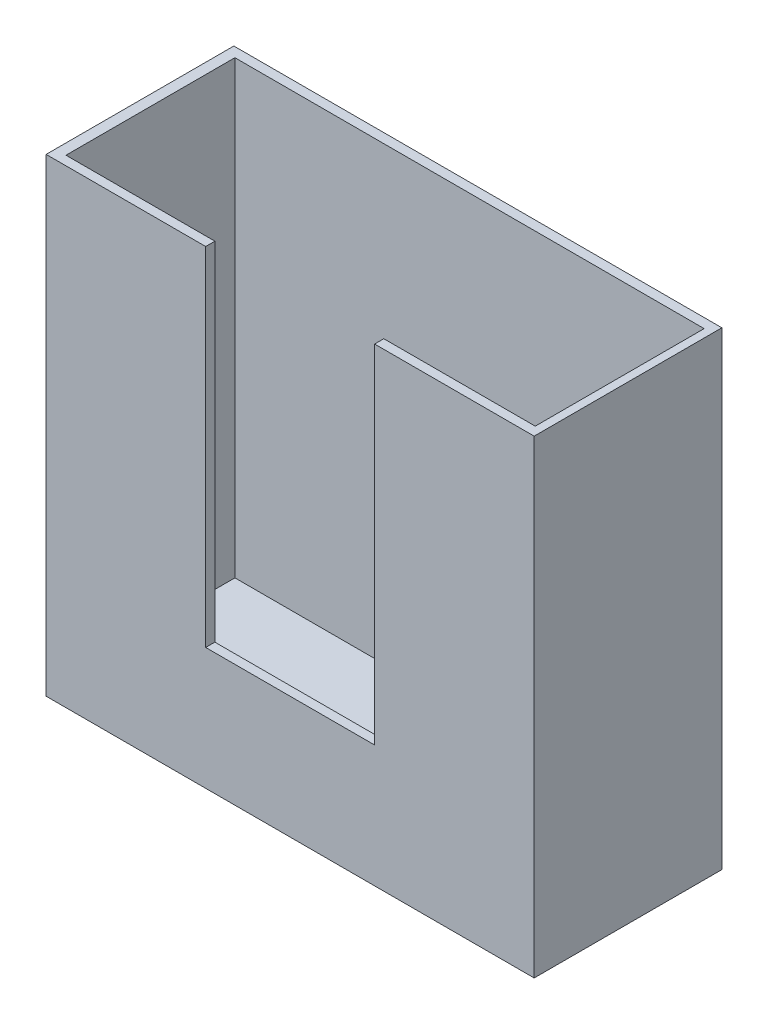
ISO-10303-21;
HEADER;
FILE_DESCRIPTION(('STEP AP214'),'2;1');
FILE_NAME('part.step','',(''),(''),'','','');
FILE_SCHEMA(('AUTOMOTIVE_DESIGN { 1 0 10303 214 1 1 1 1 }'));
ENDSEC;
DATA;
#1=APPLICATION_CONTEXT('core data for automotive mechanical design processes');
#2=APPLICATION_PROTOCOL_DEFINITION('international standard','automotive_design',2000,#1);
#3=PRODUCT_CONTEXT('',#1,'mechanical');
#4=PRODUCT('Part','Part','',(#3));
#5=PRODUCT_RELATED_PRODUCT_CATEGORY('part','',(#4));
#6=PRODUCT_DEFINITION_FORMATION('','',#4);
#7=PRODUCT_DEFINITION_CONTEXT('part definition',#1,'design');
#8=PRODUCT_DEFINITION('design','',#6,#7);
#9=PRODUCT_DEFINITION_SHAPE('','',#8);
#10=(LENGTH_UNIT() NAMED_UNIT(*) SI_UNIT(.MILLI.,.METRE.));
#11=(NAMED_UNIT(*) PLANE_ANGLE_UNIT() SI_UNIT($,.RADIAN.));
#12=(NAMED_UNIT(*) SI_UNIT($,.STERADIAN.) SOLID_ANGLE_UNIT());
#13=UNCERTAINTY_MEASURE_WITH_UNIT(LENGTH_MEASURE(1.E-05),#10,'distance_accuracy_value','');
#14=(GEOMETRIC_REPRESENTATION_CONTEXT(3) GLOBAL_UNCERTAINTY_ASSIGNED_CONTEXT((#13)) GLOBAL_UNIT_ASSIGNED_CONTEXT((#10,
#11,#12)) REPRESENTATION_CONTEXT('',''));
#15=CARTESIAN_POINT('',(0.,0.,0.));
#16=DIRECTION('',(0.,0.,1.));
#17=DIRECTION('',(1.,0.,0.));
#18=AXIS2_PLACEMENT_3D('',#15,#16,#17);
#19=CARTESIAN_POINT('',(13.,12.5,10.));
#20=DIRECTION('',(0.,-1.,0.));
#21=DIRECTION('',(1.,0.,0.));
#22=AXIS2_PLACEMENT_3D('',#19,#20,#21);
#23=PLANE('',#22);
#24=DIRECTION('',(-1.,0.,0.));
#25=VECTOR('',#24,1.);
#26=CARTESIAN_POINT('',(13.,12.5,10.));
#27=LINE('',#26,#25);
#28=CARTESIAN_POINT('',(-4.5,12.5,10.));
#29=VERTEX_POINT('',#28);
#30=CARTESIAN_POINT('',(-13.,12.5,10.));
#31=VERTEX_POINT('',#30);
#32=EDGE_CURVE('E182',#29,#31,#27,.T.);
#33=ORIENTED_EDGE('',*,*,#32,.F.);
#34=DIRECTION('',(0.,0.,1.));
#35=VECTOR('',#34,1.);
#36=CARTESIAN_POINT('',(-4.5,12.5,5.));
#37=LINE('',#36,#35);
#38=CARTESIAN_POINT('',(-4.5,12.5,9.51050607817674));
#39=VERTEX_POINT('',#38);
#40=EDGE_CURVE('E146',#39,#29,#37,.T.);
#41=ORIENTED_EDGE('',*,*,#40,.F.);
#42=DIRECTION('',(1.,0.,0.));
#43=VECTOR('',#42,1.);
#44=CARTESIAN_POINT('',(-12.4321877572133,12.5,9.51050607817674));
#45=LINE('',#44,#43);
#46=CARTESIAN_POINT('',(-12.4321877572133,12.5,9.51050607817674));
#47=VERTEX_POINT('',#46);
#48=EDGE_CURVE('E161',#47,#39,#45,.T.);
#49=ORIENTED_EDGE('',*,*,#48,.F.);
#50=DIRECTION('',(0.,0.,1.));
#51=VECTOR('',#50,1.);
#52=CARTESIAN_POINT('',(-12.4321877572133,12.5,0.510506078176745));
#53=LINE('',#52,#51);
#54=CARTESIAN_POINT('',(-12.4321877572133,12.5,0.510506078176745));
#55=VERTEX_POINT('',#54);
#56=EDGE_CURVE('E153',#55,#47,#53,.T.);
#57=ORIENTED_EDGE('',*,*,#56,.F.);
#58=DIRECTION('',(1.,0.,0.));
#59=VECTOR('',#58,1.);
#60=CARTESIAN_POINT('',(-12.4321877572133,12.5,0.510506078176745));
#61=LINE('',#60,#59);
#62=CARTESIAN_POINT('',(12.5678122427867,12.5,0.510506078176745));
#63=VERTEX_POINT('',#62);
#64=EDGE_CURVE('E167',#55,#63,#61,.T.);
#65=ORIENTED_EDGE('',*,*,#64,.T.);
#66=DIRECTION('',(0.,0.,1.));
#67=VECTOR('',#66,1.);
#68=CARTESIAN_POINT('',(12.5678122427867,12.5,0.510506078176745));
#69=LINE('',#68,#67);
#70=CARTESIAN_POINT('',(12.5678122427867,12.5,9.51050607817674));
#71=VERTEX_POINT('',#70);
#72=EDGE_CURVE('E164',#63,#71,#69,.T.);
#73=ORIENTED_EDGE('',*,*,#72,.T.);
#74=CARTESIAN_POINT('',(4.5,12.5,9.51050607817674));
#75=VERTEX_POINT('',#74);
#76=EDGE_CURVE('E53',#75,#71,#45,.T.);
#77=ORIENTED_EDGE('',*,*,#76,.F.);
#78=DIRECTION('',(0.,0.,1.));
#79=VECTOR('',#78,1.);
#80=CARTESIAN_POINT('',(4.5,12.5,5.));
#81=LINE('',#80,#79);
#82=CARTESIAN_POINT('',(4.5,12.5,10.));
#83=VERTEX_POINT('',#82);
#84=EDGE_CURVE('E46',#75,#83,#81,.T.);
#85=ORIENTED_EDGE('',*,*,#84,.T.);
#86=CARTESIAN_POINT('',(13.,12.5,10.));
#87=VERTEX_POINT('',#86);
#88=EDGE_CURVE('E141',#87,#83,#27,.T.);
#89=ORIENTED_EDGE('',*,*,#88,.F.);
#90=DIRECTION('',(0.,0.,-1.));
#91=VECTOR('',#90,1.);
#92=CARTESIAN_POINT('',(13.,12.5,10.));
#93=LINE('',#92,#91);
#94=CARTESIAN_POINT('',(13.,12.5,0.));
#95=VERTEX_POINT('',#94);
#96=EDGE_CURVE('E190',#87,#95,#93,.T.);
#97=ORIENTED_EDGE('',*,*,#96,.T.);
#98=DIRECTION('',(-1.,0.,0.));
#99=VECTOR('',#98,1.);
#100=CARTESIAN_POINT('',(13.,12.5,0.));
#101=LINE('',#100,#99);
#102=CARTESIAN_POINT('',(-13.,12.5,0.));
#103=VERTEX_POINT('',#102);
#104=EDGE_CURVE('E174',#95,#103,#101,.T.);
#105=ORIENTED_EDGE('',*,*,#104,.T.);
#106=DIRECTION('',(0.,0.,-1.));
#107=VECTOR('',#106,1.);
#108=CARTESIAN_POINT('',(-13.,12.5,10.));
#109=LINE('',#108,#107);
#110=EDGE_CURVE('E207',#31,#103,#109,.T.);
#111=ORIENTED_EDGE('',*,*,#110,.F.);
#112=EDGE_LOOP('',(#33,#41,#49,#57,#65,#73,#77,#85,#89,#97,#105,#111));
#113=FACE_BOUND('',#112,.T.);
#114=ADVANCED_FACE('F32',(#113),#23,.F.);
#115=CARTESIAN_POINT('',(-13.,-12.5,10.));
#116=DIRECTION('',(-1.,0.,0.));
#117=DIRECTION('',(0.,-1.,0.));
#118=AXIS2_PLACEMENT_3D('',#115,#116,#117);
#119=PLANE('',#118);
#120=DIRECTION('',(0.,1.,0.));
#121=VECTOR('',#120,1.);
#122=CARTESIAN_POINT('',(-13.,-12.5,0.));
#123=LINE('',#122,#121);
#124=CARTESIAN_POINT('',(-13.,-12.5,0.));
#125=VERTEX_POINT('',#124);
#126=EDGE_CURVE('E193',#125,#103,#123,.T.);
#127=ORIENTED_EDGE('',*,*,#126,.F.);
#128=DIRECTION('',(0.,0.,-1.));
#129=VECTOR('',#128,1.);
#130=CARTESIAN_POINT('',(-13.,-12.5,10.));
#131=LINE('',#130,#129);
#132=CARTESIAN_POINT('',(-13.,-12.5,10.));
#133=VERTEX_POINT('',#132);
#134=EDGE_CURVE('E205',#133,#125,#131,.T.);
#135=ORIENTED_EDGE('',*,*,#134,.F.);
#136=DIRECTION('',(0.,1.,0.));
#137=VECTOR('',#136,1.);
#138=CARTESIAN_POINT('',(-13.,-12.5,10.));
#139=LINE('',#138,#137);
#140=EDGE_CURVE('E181',#133,#31,#139,.T.);
#141=ORIENTED_EDGE('',*,*,#140,.T.);
#142=ORIENTED_EDGE('',*,*,#110,.T.);
#143=EDGE_LOOP('',(#127,#135,#141,#142));
#144=FACE_BOUND('',#143,.T.);
#145=ADVANCED_FACE('F221',(#144),#119,.T.);
#146=CARTESIAN_POINT('',(13.,-12.5,10.));
#147=DIRECTION('',(0.,-1.,0.));
#148=DIRECTION('',(1.,0.,0.));
#149=AXIS2_PLACEMENT_3D('',#146,#147,#148);
#150=PLANE('',#149);
#151=DIRECTION('',(-1.,0.,0.));
#152=VECTOR('',#151,1.);
#153=CARTESIAN_POINT('',(13.,-12.5,0.));
#154=LINE('',#153,#152);
#155=CARTESIAN_POINT('',(13.,-12.5,0.));
#156=VERTEX_POINT('',#155);
#157=EDGE_CURVE('E196',#156,#125,#154,.T.);
#158=ORIENTED_EDGE('',*,*,#157,.F.);
#159=DIRECTION('',(0.,0.,-1.));
#160=VECTOR('',#159,1.);
#161=CARTESIAN_POINT('',(13.,-12.5,10.));
#162=LINE('',#161,#160);
#163=CARTESIAN_POINT('',(13.,-12.5,10.));
#164=VERTEX_POINT('',#163);
#165=EDGE_CURVE('E203',#164,#156,#162,.T.);
#166=ORIENTED_EDGE('',*,*,#165,.F.);
#167=DIRECTION('',(-1.,0.,0.));
#168=VECTOR('',#167,1.);
#169=CARTESIAN_POINT('',(13.,-12.5,10.));
#170=LINE('',#169,#168);
#171=EDGE_CURVE('E185',#164,#133,#170,.T.);
#172=ORIENTED_EDGE('',*,*,#171,.T.);
#173=ORIENTED_EDGE('',*,*,#134,.T.);
#174=EDGE_LOOP('',(#158,#166,#172,#173));
#175=FACE_BOUND('',#174,.T.);
#176=ADVANCED_FACE('F225',(#175),#150,.T.);
#177=CARTESIAN_POINT('',(13.,-12.5,10.));
#178=DIRECTION('',(-1.,0.,0.));
#179=DIRECTION('',(0.,-1.,0.));
#180=AXIS2_PLACEMENT_3D('',#177,#178,#179);
#181=PLANE('',#180);
#182=DIRECTION('',(0.,1.,0.));
#183=VECTOR('',#182,1.);
#184=CARTESIAN_POINT('',(13.,-12.5,0.));
#185=LINE('',#184,#183);
#186=EDGE_CURVE('E199',#156,#95,#185,.T.);
#187=ORIENTED_EDGE('',*,*,#186,.T.);
#188=ORIENTED_EDGE('',*,*,#96,.F.);
#189=DIRECTION('',(0.,1.,0.));
#190=VECTOR('',#189,1.);
#191=CARTESIAN_POINT('',(13.,-12.5,10.));
#192=LINE('',#191,#190);
#193=EDGE_CURVE('E188',#164,#87,#192,.T.);
#194=ORIENTED_EDGE('',*,*,#193,.F.);
#195=ORIENTED_EDGE('',*,*,#165,.T.);
#196=EDGE_LOOP('',(#187,#188,#194,#195));
#197=FACE_BOUND('',#196,.T.);
#198=ADVANCED_FACE('F230',(#197),#181,.F.);
#199=CARTESIAN_POINT('',(0.,0.,10.));
#200=DIRECTION('',(0.,0.,-1.));
#201=DIRECTION('',(-1.,0.,0.));
#202=AXIS2_PLACEMENT_3D('',#199,#200,#201);
#203=PLANE('',#202);
#204=DIRECTION('',(1.,0.,0.));
#205=VECTOR('',#204,1.);
#206=CARTESIAN_POINT('',(-4.5,-5.99999999999999,10.));
#207=LINE('',#206,#205);
#208=CARTESIAN_POINT('',(-4.5,-5.99999999999999,10.));
#209=VERTEX_POINT('',#208);
#210=CARTESIAN_POINT('',(4.5,-5.99999999999999,10.));
#211=VERTEX_POINT('',#210);
#212=EDGE_CURVE('E130',#209,#211,#207,.T.);
#213=ORIENTED_EDGE('',*,*,#212,.F.);
#214=DIRECTION('',(0.,-1.,0.));
#215=VECTOR('',#214,1.);
#216=CARTESIAN_POINT('',(-4.5,12.5,10.));
#217=LINE('',#216,#215);
#218=EDGE_CURVE('E127',#29,#209,#217,.T.);
#219=ORIENTED_EDGE('',*,*,#218,.F.);
#220=ORIENTED_EDGE('',*,*,#32,.T.);
#221=ORIENTED_EDGE('',*,*,#140,.F.);
#222=ORIENTED_EDGE('',*,*,#171,.F.);
#223=ORIENTED_EDGE('',*,*,#193,.T.);
#224=ORIENTED_EDGE('',*,*,#88,.T.);
#225=DIRECTION('',(0.,-1.,0.));
#226=VECTOR('',#225,1.);
#227=CARTESIAN_POINT('',(4.5,12.5,10.));
#228=LINE('',#227,#226);
#229=EDGE_CURVE('E123',#83,#211,#228,.T.);
#230=ORIENTED_EDGE('',*,*,#229,.T.);
#231=EDGE_LOOP('',(#213,#219,#220,#221,#222,#223,#224,#230));
#232=FACE_BOUND('',#231,.T.);
#233=ADVANCED_FACE('F139',(#232),#203,.F.);
#234=CARTESIAN_POINT('',(0.,0.,0.));
#235=DIRECTION('',(0.,0.,-1.));
#236=DIRECTION('',(-1.,0.,0.));
#237=AXIS2_PLACEMENT_3D('',#234,#235,#236);
#238=PLANE('',#237);
#239=ORIENTED_EDGE('',*,*,#104,.F.);
#240=ORIENTED_EDGE('',*,*,#186,.F.);
#241=ORIENTED_EDGE('',*,*,#157,.T.);
#242=ORIENTED_EDGE('',*,*,#126,.T.);
#243=EDGE_LOOP('',(#239,#240,#241,#242));
#244=FACE_BOUND('',#243,.T.);
#245=ADVANCED_FACE('F266',(#244),#238,.T.);
#246=CARTESIAN_POINT('',(-12.4321877572133,-11.5,9.51050607817674));
#247=DIRECTION('',(0.,0.,1.));
#248=DIRECTION('',(1.,0.,0.));
#249=AXIS2_PLACEMENT_3D('',#246,#247,#248);
#250=PLANE('',#249);
#251=ORIENTED_EDGE('',*,*,#48,.T.);
#252=DIRECTION('',(0.,-1.,0.));
#253=VECTOR('',#252,1.);
#254=CARTESIAN_POINT('',(-4.5,-11.5,9.51050607817674));
#255=LINE('',#254,#253);
#256=CARTESIAN_POINT('',(-4.5,-5.99999999999999,9.51050607817674));
#257=VERTEX_POINT('',#256);
#258=EDGE_CURVE('E11',#39,#257,#255,.T.);
#259=ORIENTED_EDGE('',*,*,#258,.T.);
#260=DIRECTION('',(1.,0.,0.));
#261=VECTOR('',#260,1.);
#262=CARTESIAN_POINT('',(-12.4321877572133,-5.99999999999999,9.51050607817674));
#263=LINE('',#262,#261);
#264=CARTESIAN_POINT('',(4.5,-5.99999999999999,9.51050607817674));
#265=VERTEX_POINT('',#264);
#266=EDGE_CURVE('E39',#257,#265,#263,.T.);
#267=ORIENTED_EDGE('',*,*,#266,.T.);
#268=DIRECTION('',(0.,-1.,0.));
#269=VECTOR('',#268,1.);
#270=CARTESIAN_POINT('',(4.5,-11.5,9.51050607817674));
#271=LINE('',#270,#269);
#272=EDGE_CURVE('E124',#75,#265,#271,.T.);
#273=ORIENTED_EDGE('',*,*,#272,.F.);
#274=ORIENTED_EDGE('',*,*,#76,.T.);
#275=DIRECTION('',(0.,1.,0.));
#276=VECTOR('',#275,1.);
#277=CARTESIAN_POINT('',(12.5678122427867,-11.5,9.51050607817674));
#278=LINE('',#277,#276);
#279=CARTESIAN_POINT('',(12.5678122427867,-11.5,9.51050607817674));
#280=VERTEX_POINT('',#279);
#281=EDGE_CURVE('E160',#280,#71,#278,.T.);
#282=ORIENTED_EDGE('',*,*,#281,.F.);
#283=DIRECTION('',(1.,0.,0.));
#284=VECTOR('',#283,1.);
#285=CARTESIAN_POINT('',(-12.4321877572133,-11.5,9.51050607817674));
#286=LINE('',#285,#284);
#287=CARTESIAN_POINT('',(-12.4321877572133,-11.5,9.51050607817674));
#288=VERTEX_POINT('',#287);
#289=EDGE_CURVE('E149',#288,#280,#286,.T.);
#290=ORIENTED_EDGE('',*,*,#289,.F.);
#291=DIRECTION('',(0.,1.,0.));
#292=VECTOR('',#291,1.);
#293=CARTESIAN_POINT('',(-12.4321877572133,-11.5,9.51050607817674));
#294=LINE('',#293,#292);
#295=EDGE_CURVE('E172',#288,#47,#294,.T.);
#296=ORIENTED_EDGE('',*,*,#295,.T.);
#297=EDGE_LOOP('',(#251,#259,#267,#273,#274,#282,#290,#296));
#298=FACE_BOUND('',#297,.T.);
#299=ADVANCED_FACE('F209',(#298),#250,.F.);
#300=CARTESIAN_POINT('',(-12.4321877572133,-11.5,0.510506078176745));
#301=DIRECTION('',(-1.,0.,0.));
#302=DIRECTION('',(0.,-1.,0.));
#303=AXIS2_PLACEMENT_3D('',#300,#301,#302);
#304=PLANE('',#303);
#305=ORIENTED_EDGE('',*,*,#56,.T.);
#306=ORIENTED_EDGE('',*,*,#295,.F.);
#307=DIRECTION('',(0.,0.,1.));
#308=VECTOR('',#307,1.);
#309=CARTESIAN_POINT('',(-12.4321877572133,-11.5,0.510506078176745));
#310=LINE('',#309,#308);
#311=CARTESIAN_POINT('',(-12.4321877572133,-11.5,0.510506078176745));
#312=VERTEX_POINT('',#311);
#313=EDGE_CURVE('E157',#312,#288,#310,.T.);
#314=ORIENTED_EDGE('',*,*,#313,.F.);
#315=DIRECTION('',(0.,1.,0.));
#316=VECTOR('',#315,1.);
#317=CARTESIAN_POINT('',(-12.4321877572133,-11.5,0.510506078176745));
#318=LINE('',#317,#316);
#319=EDGE_CURVE('E175',#312,#55,#318,.T.);
#320=ORIENTED_EDGE('',*,*,#319,.T.);
#321=EDGE_LOOP('',(#305,#306,#314,#320));
#322=FACE_BOUND('',#321,.T.);
#323=ADVANCED_FACE('F244',(#322),#304,.F.);
#324=CARTESIAN_POINT('',(-12.4321877572133,-11.5,0.510506078176745));
#325=DIRECTION('',(0.,0.,1.));
#326=DIRECTION('',(1.,0.,0.));
#327=AXIS2_PLACEMENT_3D('',#324,#325,#326);
#328=PLANE('',#327);
#329=ORIENTED_EDGE('',*,*,#64,.F.);
#330=ORIENTED_EDGE('',*,*,#319,.F.);
#331=DIRECTION('',(1.,0.,0.));
#332=VECTOR('',#331,1.);
#333=CARTESIAN_POINT('',(-12.4321877572133,-11.5,0.510506078176745));
#334=LINE('',#333,#332);
#335=CARTESIAN_POINT('',(12.5678122427867,-11.5,0.510506078176745));
#336=VERTEX_POINT('',#335);
#337=EDGE_CURVE('E155',#312,#336,#334,.T.);
#338=ORIENTED_EDGE('',*,*,#337,.T.);
#339=DIRECTION('',(0.,1.,0.));
#340=VECTOR('',#339,1.);
#341=CARTESIAN_POINT('',(12.5678122427867,-11.5,0.510506078176745));
#342=LINE('',#341,#340);
#343=EDGE_CURVE('E177',#336,#63,#342,.T.);
#344=ORIENTED_EDGE('',*,*,#343,.T.);
#345=EDGE_LOOP('',(#329,#330,#338,#344));
#346=FACE_BOUND('',#345,.T.);
#347=ADVANCED_FACE('F246',(#346),#328,.T.);
#348=CARTESIAN_POINT('',(12.5678122427867,-11.5,0.510506078176745));
#349=DIRECTION('',(-1.,0.,0.));
#350=DIRECTION('',(0.,0.,1.));
#351=AXIS2_PLACEMENT_3D('',#348,#349,#350);
#352=PLANE('',#351);
#353=ORIENTED_EDGE('',*,*,#72,.F.);
#354=ORIENTED_EDGE('',*,*,#343,.F.);
#355=DIRECTION('',(0.,0.,1.));
#356=VECTOR('',#355,1.);
#357=CARTESIAN_POINT('',(12.5678122427867,-11.5,0.510506078176745));
#358=LINE('',#357,#356);
#359=EDGE_CURVE('E152',#336,#280,#358,.T.);
#360=ORIENTED_EDGE('',*,*,#359,.T.);
#361=ORIENTED_EDGE('',*,*,#281,.T.);
#362=EDGE_LOOP('',(#353,#354,#360,#361));
#363=FACE_BOUND('',#362,.T.);
#364=ADVANCED_FACE('F236',(#363),#352,.T.);
#365=CARTESIAN_POINT('',(0.,-11.5,0.));
#366=DIRECTION('',(0.,-1.,0.));
#367=DIRECTION('',(1.,0.,0.));
#368=AXIS2_PLACEMENT_3D('',#365,#366,#367);
#369=PLANE('',#368);
#370=ORIENTED_EDGE('',*,*,#289,.T.);
#371=ORIENTED_EDGE('',*,*,#359,.F.);
#372=ORIENTED_EDGE('',*,*,#337,.F.);
#373=ORIENTED_EDGE('',*,*,#313,.T.);
#374=EDGE_LOOP('',(#370,#371,#372,#373));
#375=FACE_BOUND('',#374,.T.);
#376=ADVANCED_FACE('F240',(#375),#369,.F.);
#377=CARTESIAN_POINT('',(-4.5,-5.99999999999999,5.));
#378=DIRECTION('',(0.,-1.,0.));
#379=DIRECTION('',(0.,0.,-1.));
#380=AXIS2_PLACEMENT_3D('',#377,#378,#379);
#381=PLANE('',#380);
#382=DIRECTION('',(0.,0.,1.));
#383=VECTOR('',#382,1.);
#384=CARTESIAN_POINT('',(-4.5,-5.99999999999999,5.));
#385=LINE('',#384,#383);
#386=EDGE_CURVE('E133',#257,#209,#385,.T.);
#387=ORIENTED_EDGE('',*,*,#386,.T.);
#388=ORIENTED_EDGE('',*,*,#212,.T.);
#389=DIRECTION('',(0.,0.,1.));
#390=VECTOR('',#389,1.);
#391=CARTESIAN_POINT('',(4.5,-5.99999999999999,5.));
#392=LINE('',#391,#390);
#393=EDGE_CURVE('E119',#265,#211,#392,.T.);
#394=ORIENTED_EDGE('',*,*,#393,.F.);
#395=ORIENTED_EDGE('',*,*,#266,.F.);
#396=EDGE_LOOP('',(#387,#388,#394,#395));
#397=FACE_BOUND('',#396,.T.);
#398=ADVANCED_FACE('F131',(#397),#381,.F.);
#399=CARTESIAN_POINT('',(-4.5,12.5,5.));
#400=DIRECTION('',(-1.,0.,0.));
#401=DIRECTION('',(0.,-1.,0.));
#402=AXIS2_PLACEMENT_3D('',#399,#400,#401);
#403=PLANE('',#402);
#404=ORIENTED_EDGE('',*,*,#40,.T.);
#405=ORIENTED_EDGE('',*,*,#218,.T.);
#406=ORIENTED_EDGE('',*,*,#386,.F.);
#407=ORIENTED_EDGE('',*,*,#258,.F.);
#408=EDGE_LOOP('',(#404,#405,#406,#407));
#409=FACE_BOUND('',#408,.T.);
#410=ADVANCED_FACE('F211',(#409),#403,.F.);
#411=CARTESIAN_POINT('',(4.5,12.5,5.));
#412=DIRECTION('',(-1.,0.,0.));
#413=DIRECTION('',(0.,-1.,0.));
#414=AXIS2_PLACEMENT_3D('',#411,#412,#413);
#415=PLANE('',#414);
#416=ORIENTED_EDGE('',*,*,#272,.T.);
#417=ORIENTED_EDGE('',*,*,#393,.T.);
#418=ORIENTED_EDGE('',*,*,#229,.F.);
#419=ORIENTED_EDGE('',*,*,#84,.F.);
#420=EDGE_LOOP('',(#416,#417,#418,#419));
#421=FACE_BOUND('',#420,.T.);
#422=ADVANCED_FACE('F121',(#421),#415,.T.);
#423=CLOSED_SHELL('',(#114,#145,#176,#198,#233,#245,#299,#323,#347,#364,#376,#398,#410,#422));
#424=MANIFOLD_SOLID_BREP('B2',#423);
#425=ADVANCED_BREP_SHAPE_REPRESENTATION('',(#18,#424),#14);
#426=SHAPE_DEFINITION_REPRESENTATION(#9,#425);
ENDSEC;
END-ISO-10303-21;
